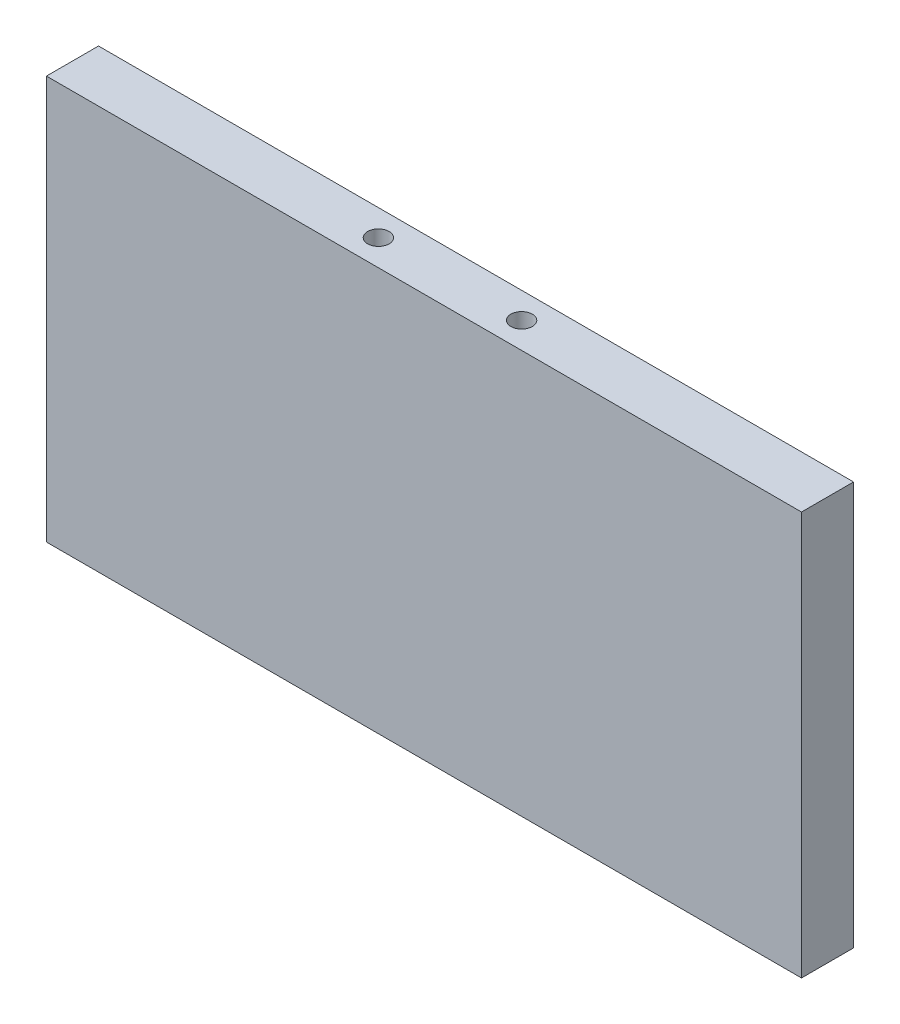
ISO-10303-21;
HEADER;
FILE_DESCRIPTION(('STEP AP214'),'2;1');
FILE_NAME('part.step','',(''),(''),'','','');
FILE_SCHEMA(('AUTOMOTIVE_DESIGN { 1 0 10303 214 1 1 1 1 }'));
ENDSEC;
DATA;
#1=APPLICATION_CONTEXT('core data for automotive mechanical design processes');
#2=APPLICATION_PROTOCOL_DEFINITION('international standard','automotive_design',2000,#1);
#3=PRODUCT_CONTEXT('',#1,'mechanical');
#4=PRODUCT('Part','Part','',(#3));
#5=PRODUCT_RELATED_PRODUCT_CATEGORY('part','',(#4));
#6=PRODUCT_DEFINITION_FORMATION('','',#4);
#7=PRODUCT_DEFINITION_CONTEXT('part definition',#1,'design');
#8=PRODUCT_DEFINITION('design','',#6,#7);
#9=PRODUCT_DEFINITION_SHAPE('','',#8);
#10=(LENGTH_UNIT() NAMED_UNIT(*) SI_UNIT(.MILLI.,.METRE.));
#11=(NAMED_UNIT(*) PLANE_ANGLE_UNIT() SI_UNIT($,.RADIAN.));
#12=(NAMED_UNIT(*) SI_UNIT($,.STERADIAN.) SOLID_ANGLE_UNIT());
#13=UNCERTAINTY_MEASURE_WITH_UNIT(LENGTH_MEASURE(1.E-05),#10,'distance_accuracy_value','');
#14=(GEOMETRIC_REPRESENTATION_CONTEXT(3) GLOBAL_UNCERTAINTY_ASSIGNED_CONTEXT((#13)) GLOBAL_UNIT_ASSIGNED_CONTEXT((#10,
#11,#12)) REPRESENTATION_CONTEXT('',''));
#15=CARTESIAN_POINT('',(0.,0.,0.));
#16=DIRECTION('',(0.,0.,1.));
#17=DIRECTION('',(1.,0.,0.));
#18=AXIS2_PLACEMENT_3D('',#15,#16,#17);
#19=CARTESIAN_POINT('',(0.,0.,8.));
#20=DIRECTION('',(1.,0.,0.));
#21=DIRECTION('',(0.,0.,-1.));
#22=AXIS2_PLACEMENT_3D('',#19,#20,#21);
#23=PLANE('',#22);
#24=DIRECTION('',(0.,-1.,0.));
#25=VECTOR('',#24,1.);
#26=CARTESIAN_POINT('',(0.,0.,0.));
#27=LINE('',#26,#25);
#28=CARTESIAN_POINT('',(0.,62.,0.));
#29=VERTEX_POINT('',#28);
#30=CARTESIAN_POINT('',(0.,0.,0.));
#31=VERTEX_POINT('',#30);
#32=EDGE_CURVE('E95',#29,#31,#27,.T.);
#33=ORIENTED_EDGE('',*,*,#32,.T.);
#34=DIRECTION('',(0.,0.,-1.));
#35=VECTOR('',#34,1.);
#36=CARTESIAN_POINT('',(0.,0.,8.));
#37=LINE('',#36,#35);
#38=CARTESIAN_POINT('',(0.,0.,8.));
#39=VERTEX_POINT('',#38);
#40=EDGE_CURVE('E11',#39,#31,#37,.T.);
#41=ORIENTED_EDGE('',*,*,#40,.F.);
#42=DIRECTION('',(0.,-1.,0.));
#43=VECTOR('',#42,1.);
#44=CARTESIAN_POINT('',(0.,0.,8.));
#45=LINE('',#44,#43);
#46=CARTESIAN_POINT('',(0.,62.,8.));
#47=VERTEX_POINT('',#46);
#48=EDGE_CURVE('E83',#47,#39,#45,.T.);
#49=ORIENTED_EDGE('',*,*,#48,.F.);
#50=DIRECTION('',(0.,0.,-1.));
#51=VECTOR('',#50,1.);
#52=CARTESIAN_POINT('',(0.,62.,8.));
#53=LINE('',#52,#51);
#54=EDGE_CURVE('E91',#47,#29,#53,.T.);
#55=ORIENTED_EDGE('',*,*,#54,.T.);
#56=EDGE_LOOP('',(#33,#41,#49,#55));
#57=FACE_BOUND('',#56,.T.);
#58=ADVANCED_FACE('F32',(#57),#23,.F.);
#59=CARTESIAN_POINT('',(0.,0.,8.));
#60=DIRECTION('',(0.,1.,0.));
#61=DIRECTION('',(0.,0.,1.));
#62=AXIS2_PLACEMENT_3D('',#59,#60,#61);
#63=PLANE('',#62);
#64=DIRECTION('',(1.,0.,0.));
#65=VECTOR('',#64,1.);
#66=CARTESIAN_POINT('',(0.,0.,0.));
#67=LINE('',#66,#65);
#68=CARTESIAN_POINT('',(116.,0.,0.));
#69=VERTEX_POINT('',#68);
#70=EDGE_CURVE('E87',#31,#69,#67,.T.);
#71=ORIENTED_EDGE('',*,*,#70,.T.);
#72=DIRECTION('',(0.,0.,-1.));
#73=VECTOR('',#72,1.);
#74=CARTESIAN_POINT('',(116.,0.,8.));
#75=LINE('',#74,#73);
#76=CARTESIAN_POINT('',(116.,0.,8.));
#77=VERTEX_POINT('',#76);
#78=EDGE_CURVE('E40',#77,#69,#75,.T.);
#79=ORIENTED_EDGE('',*,*,#78,.F.);
#80=DIRECTION('',(1.,0.,0.));
#81=VECTOR('',#80,1.);
#82=CARTESIAN_POINT('',(0.,0.,8.));
#83=LINE('',#82,#81);
#84=EDGE_CURVE('E78',#39,#77,#83,.T.);
#85=ORIENTED_EDGE('',*,*,#84,.F.);
#86=ORIENTED_EDGE('',*,*,#40,.T.);
#87=EDGE_LOOP('',(#71,#79,#85,#86));
#88=FACE_BOUND('',#87,.T.);
#89=ADVANCED_FACE('F86',(#88),#63,.F.);
#90=CARTESIAN_POINT('',(116.,0.,8.));
#91=DIRECTION('',(-1.,0.,0.));
#92=DIRECTION('',(0.,0.,1.));
#93=AXIS2_PLACEMENT_3D('',#90,#91,#92);
#94=PLANE('',#93);
#95=DIRECTION('',(0.,1.,0.));
#96=VECTOR('',#95,1.);
#97=CARTESIAN_POINT('',(116.,0.,0.));
#98=LINE('',#97,#96);
#99=CARTESIAN_POINT('',(116.,62.,0.));
#100=VERTEX_POINT('',#99);
#101=EDGE_CURVE('E65',#69,#100,#98,.T.);
#102=ORIENTED_EDGE('',*,*,#101,.T.);
#103=DIRECTION('',(0.,0.,-1.));
#104=VECTOR('',#103,1.);
#105=CARTESIAN_POINT('',(116.,62.,8.));
#106=LINE('',#105,#104);
#107=CARTESIAN_POINT('',(116.,62.,8.));
#108=VERTEX_POINT('',#107);
#109=EDGE_CURVE('E88',#108,#100,#106,.T.);
#110=ORIENTED_EDGE('',*,*,#109,.F.);
#111=DIRECTION('',(0.,1.,0.));
#112=VECTOR('',#111,1.);
#113=CARTESIAN_POINT('',(116.,0.,8.));
#114=LINE('',#113,#112);
#115=EDGE_CURVE('E81',#77,#108,#114,.T.);
#116=ORIENTED_EDGE('',*,*,#115,.F.);
#117=ORIENTED_EDGE('',*,*,#78,.T.);
#118=EDGE_LOOP('',(#102,#110,#116,#117));
#119=FACE_BOUND('',#118,.T.);
#120=ADVANCED_FACE('F89',(#119),#94,.F.);
#121=CARTESIAN_POINT('',(0.,62.,8.));
#122=DIRECTION('',(0.,-1.,0.));
#123=DIRECTION('',(0.,0.,-1.));
#124=AXIS2_PLACEMENT_3D('',#121,#122,#123);
#125=PLANE('',#124);
#126=CARTESIAN_POINT('',(69.,62.,4.));
#127=DIRECTION('',(0.,1.,0.));
#128=DIRECTION('',(0.,0.,-1.));
#129=AXIS2_PLACEMENT_3D('',#126,#127,#128);
#130=CIRCLE('',#129,1.65);
#131=CARTESIAN_POINT('',(69.,62.,2.35));
#132=VERTEX_POINT('',#131);
#133=EDGE_CURVE('E115',#132,#132,#130,.T.);
#134=ORIENTED_EDGE('',*,*,#133,.F.);
#135=EDGE_LOOP('',(#134));
#136=FACE_BOUND('',#135,.T.);
#137=CARTESIAN_POINT('',(47.,62.,4.));
#138=DIRECTION('',(0.,1.,0.));
#139=DIRECTION('',(0.,0.,1.));
#140=AXIS2_PLACEMENT_3D('',#137,#138,#139);
#141=CIRCLE('',#140,1.65);
#142=CARTESIAN_POINT('',(47.,62.,5.65));
#143=VERTEX_POINT('',#142);
#144=EDGE_CURVE('E109',#143,#143,#141,.T.);
#145=ORIENTED_EDGE('',*,*,#144,.F.);
#146=EDGE_LOOP('',(#145));
#147=FACE_BOUND('',#146,.T.);
#148=DIRECTION('',(-1.,0.,0.));
#149=VECTOR('',#148,1.);
#150=CARTESIAN_POINT('',(0.,62.,0.));
#151=LINE('',#150,#149);
#152=EDGE_CURVE('E71',#100,#29,#151,.T.);
#153=ORIENTED_EDGE('',*,*,#152,.T.);
#154=ORIENTED_EDGE('',*,*,#54,.F.);
#155=DIRECTION('',(-1.,0.,0.));
#156=VECTOR('',#155,1.);
#157=CARTESIAN_POINT('',(0.,62.,8.));
#158=LINE('',#157,#156);
#159=EDGE_CURVE('E48',#108,#47,#158,.T.);
#160=ORIENTED_EDGE('',*,*,#159,.F.);
#161=ORIENTED_EDGE('',*,*,#109,.T.);
#162=EDGE_LOOP('',(#153,#154,#160,#161));
#163=FACE_BOUND('',#162,.T.);
#164=ADVANCED_FACE('F103',(#136,#147,#163),#125,.F.);
#165=CARTESIAN_POINT('',(0.,0.,8.));
#166=DIRECTION('',(0.,0.,-1.));
#167=DIRECTION('',(-1.,0.,0.));
#168=AXIS2_PLACEMENT_3D('',#165,#166,#167);
#169=PLANE('',#168);
#170=ORIENTED_EDGE('',*,*,#48,.T.);
#171=ORIENTED_EDGE('',*,*,#84,.T.);
#172=ORIENTED_EDGE('',*,*,#115,.T.);
#173=ORIENTED_EDGE('',*,*,#159,.T.);
#174=EDGE_LOOP('',(#170,#171,#172,#173));
#175=FACE_BOUND('',#174,.T.);
#176=ADVANCED_FACE('F79',(#175),#169,.F.);
#177=CARTESIAN_POINT('',(0.,0.,0.));
#178=DIRECTION('',(0.,0.,-1.));
#179=DIRECTION('',(-1.,0.,0.));
#180=AXIS2_PLACEMENT_3D('',#177,#178,#179);
#181=PLANE('',#180);
#182=ORIENTED_EDGE('',*,*,#32,.F.);
#183=ORIENTED_EDGE('',*,*,#152,.F.);
#184=ORIENTED_EDGE('',*,*,#101,.F.);
#185=ORIENTED_EDGE('',*,*,#70,.F.);
#186=EDGE_LOOP('',(#182,#183,#184,#185));
#187=FACE_BOUND('',#186,.T.);
#188=ADVANCED_FACE('F106',(#187),#181,.T.);
#189=CARTESIAN_POINT('',(47.,52.,4.));
#190=DIRECTION('',(0.,1.,0.));
#191=DIRECTION('',(0.,0.,1.));
#192=AXIS2_PLACEMENT_3D('',#189,#190,#191);
#193=CYLINDRICAL_SURFACE('',#192,1.65);
#194=CARTESIAN_POINT('',(47.,52.,4.));
#195=DIRECTION('',(0.,1.,0.));
#196=DIRECTION('',(0.,0.,1.));
#197=AXIS2_PLACEMENT_3D('',#194,#195,#196);
#198=CIRCLE('',#197,1.65);
#199=CARTESIAN_POINT('',(47.,52.,5.65));
#200=VERTEX_POINT('',#199);
#201=EDGE_CURVE('E98',#200,#200,#198,.T.);
#202=ORIENTED_EDGE('',*,*,#201,.F.);
#203=EDGE_LOOP('',(#202));
#204=FACE_BOUND('',#203,.T.);
#205=ORIENTED_EDGE('',*,*,#144,.T.);
#206=EDGE_LOOP('',(#205));
#207=FACE_BOUND('',#206,.T.);
#208=ADVANCED_FACE('F135',(#204,#207),#193,.F.);
#209=CARTESIAN_POINT('',(47.,52.,4.));
#210=DIRECTION('',(0.,1.,0.));
#211=DIRECTION('',(0.,0.,1.));
#212=AXIS2_PLACEMENT_3D('',#209,#210,#211);
#213=PLANE('',#212);
#214=ORIENTED_EDGE('',*,*,#201,.T.);
#215=EDGE_LOOP('',(#214));
#216=FACE_BOUND('',#215,.T.);
#217=ADVANCED_FACE('F126',(#216),#213,.T.);
#218=CARTESIAN_POINT('',(69.,52.,4.));
#219=DIRECTION('',(0.,1.,0.));
#220=DIRECTION('',(0.,0.,1.));
#221=AXIS2_PLACEMENT_3D('',#218,#219,#220);
#222=CYLINDRICAL_SURFACE('',#221,1.65);
#223=CARTESIAN_POINT('',(69.,52.,4.));
#224=DIRECTION('',(0.,1.,0.));
#225=DIRECTION('',(0.,0.,-1.));
#226=AXIS2_PLACEMENT_3D('',#223,#224,#225);
#227=CIRCLE('',#226,1.65);
#228=CARTESIAN_POINT('',(69.,52.,2.35));
#229=VERTEX_POINT('',#228);
#230=EDGE_CURVE('E112',#229,#229,#227,.T.);
#231=ORIENTED_EDGE('',*,*,#230,.F.);
#232=EDGE_LOOP('',(#231));
#233=FACE_BOUND('',#232,.T.);
#234=ORIENTED_EDGE('',*,*,#133,.T.);
#235=EDGE_LOOP('',(#234));
#236=FACE_BOUND('',#235,.T.);
#237=ADVANCED_FACE('F123',(#233,#236),#222,.F.);
#238=CARTESIAN_POINT('',(69.,52.,4.));
#239=DIRECTION('',(0.,-1.,0.));
#240=DIRECTION('',(0.,0.,-1.));
#241=AXIS2_PLACEMENT_3D('',#238,#239,#240);
#242=PLANE('',#241);
#243=ORIENTED_EDGE('',*,*,#230,.T.);
#244=EDGE_LOOP('',(#243));
#245=FACE_BOUND('',#244,.T.);
#246=ADVANCED_FACE('F121',(#245),#242,.F.);
#247=CLOSED_SHELL('',(#58,#89,#120,#164,#176,#188,#208,#217,#237,#246));
#248=MANIFOLD_SOLID_BREP('B2',#247);
#249=ADVANCED_BREP_SHAPE_REPRESENTATION('',(#18,#248),#14);
#250=SHAPE_DEFINITION_REPRESENTATION(#9,#249);
ENDSEC;
END-ISO-10303-21;
